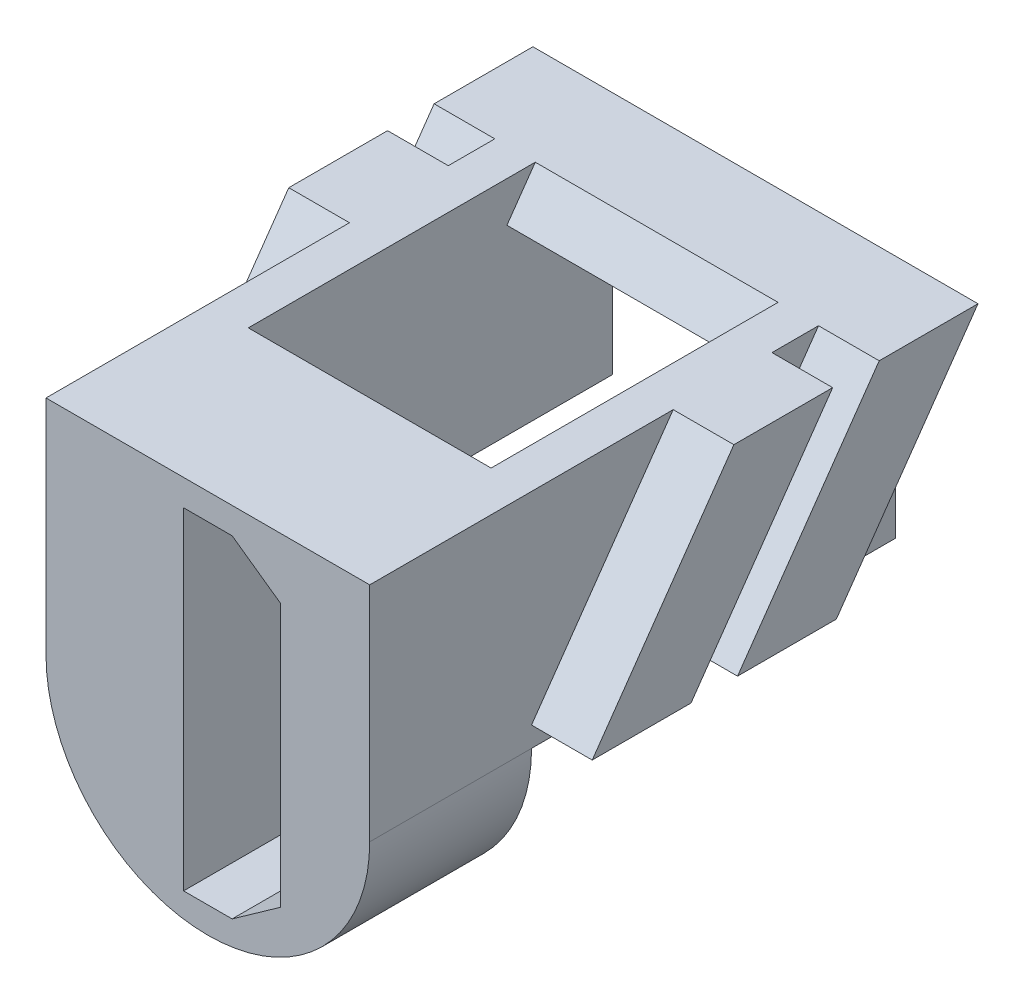
ISO-10303-21;
HEADER;
FILE_DESCRIPTION(('STEP AP214'),'2;1');
FILE_NAME('part.step','',(''),(''),'','','');
FILE_SCHEMA(('AUTOMOTIVE_DESIGN { 1 0 10303 214 1 1 1 1 }'));
ENDSEC;
DATA;
#1=APPLICATION_CONTEXT('core data for automotive mechanical design processes');
#2=APPLICATION_PROTOCOL_DEFINITION('international standard','automotive_design',2000,#1);
#3=PRODUCT_CONTEXT('',#1,'mechanical');
#4=PRODUCT('Part','Part','',(#3));
#5=PRODUCT_RELATED_PRODUCT_CATEGORY('part','',(#4));
#6=PRODUCT_DEFINITION_FORMATION('','',#4);
#7=PRODUCT_DEFINITION_CONTEXT('part definition',#1,'design');
#8=PRODUCT_DEFINITION('design','',#6,#7);
#9=PRODUCT_DEFINITION_SHAPE('','',#8);
#10=(LENGTH_UNIT() NAMED_UNIT(*) SI_UNIT(.MILLI.,.METRE.));
#11=(NAMED_UNIT(*) PLANE_ANGLE_UNIT() SI_UNIT($,.RADIAN.));
#12=(NAMED_UNIT(*) SI_UNIT($,.STERADIAN.) SOLID_ANGLE_UNIT());
#13=UNCERTAINTY_MEASURE_WITH_UNIT(LENGTH_MEASURE(1.E-05),#10,'distance_accuracy_value','');
#14=(GEOMETRIC_REPRESENTATION_CONTEXT(3) GLOBAL_UNCERTAINTY_ASSIGNED_CONTEXT((#13)) GLOBAL_UNIT_ASSIGNED_CONTEXT((#10,
#11,#12)) REPRESENTATION_CONTEXT('',''));
#15=CARTESIAN_POINT('',(0.,0.,0.));
#16=DIRECTION('',(0.,0.,1.));
#17=DIRECTION('',(1.,0.,0.));
#18=AXIS2_PLACEMENT_3D('',#15,#16,#17);
#19=CARTESIAN_POINT('',(-3.,4.75,-22.5));
#20=DIRECTION('',(-1.,0.,0.));
#21=DIRECTION('',(0.,-1.,0.));
#22=AXIS2_PLACEMENT_3D('',#19,#20,#21);
#23=PLANE('',#22);
#24=DIRECTION('',(0.,0.819152044288989,-0.573576436351051));
#25=VECTOR('',#24,1.);
#26=CARTESIAN_POINT('',(-3.,12.0170666710925,-12.1215532188174));
#27=LINE('',#26,#25);
#28=CARTESIAN_POINT('',(-3.,3.75,-6.33289081683612));
#29=VERTEX_POINT('',#28);
#30=CARTESIAN_POINT('',(-3.,3.98865664684379,-6.5));
#31=VERTEX_POINT('',#30);
#32=EDGE_CURVE('E310',#29,#31,#27,.T.);
#33=ORIENTED_EDGE('',*,*,#32,.F.);
#34=DIRECTION('',(0.,0.,-1.));
#35=VECTOR('',#34,1.);
#36=CARTESIAN_POINT('',(-3.,3.75,-22.5));
#37=LINE('',#36,#35);
#38=CARTESIAN_POINT('',(-3.,3.75,-3.89134163931321));
#39=VERTEX_POINT('',#38);
#40=EDGE_CURVE('E302',#39,#29,#37,.T.);
#41=ORIENTED_EDGE('',*,*,#40,.F.);
#42=DIRECTION('',(0.,-0.819152044288989,0.57357643635105));
#43=VECTOR('',#42,1.);
#44=CARTESIAN_POINT('',(-3.,13.1642195437946,-10.4832491302394));
#45=LINE('',#44,#43);
#46=CARTESIAN_POINT('',(-3.,4.75,-4.59154917752293));
#47=VERTEX_POINT('',#46);
#48=EDGE_CURVE('E307',#47,#39,#45,.T.);
#49=ORIENTED_EDGE('',*,*,#48,.F.);
#50=DIRECTION('',(0.,0.,1.));
#51=VECTOR('',#50,1.);
#52=CARTESIAN_POINT('',(-3.,4.75,-22.5));
#53=LINE('',#52,#51);
#54=CARTESIAN_POINT('',(-3.,4.75,2.5));
#55=VERTEX_POINT('',#54);
#56=EDGE_CURVE('E338',#47,#55,#53,.T.);
#57=ORIENTED_EDGE('',*,*,#56,.T.);
#58=DIRECTION('',(0.,-1.,0.));
#59=VECTOR('',#58,1.);
#60=CARTESIAN_POINT('',(-3.,4.75,2.5));
#61=LINE('',#60,#59);
#62=CARTESIAN_POINT('',(-3.,-0.75,2.5));
#63=VERTEX_POINT('',#62);
#64=EDGE_CURVE('E325',#55,#63,#61,.T.);
#65=ORIENTED_EDGE('',*,*,#64,.T.);
#66=DIRECTION('',(0.,0.,1.));
#67=VECTOR('',#66,1.);
#68=CARTESIAN_POINT('',(-3.,-0.75,-22.5));
#69=LINE('',#68,#67);
#70=CARTESIAN_POINT('',(-3.,-0.75,-6.5));
#71=VERTEX_POINT('',#70);
#72=EDGE_CURVE('E336',#71,#63,#69,.T.);
#73=ORIENTED_EDGE('',*,*,#72,.F.);
#74=DIRECTION('',(0.,-1.,0.));
#75=VECTOR('',#74,1.);
#76=CARTESIAN_POINT('',(-3.,-0.75,-6.5));
#77=LINE('',#76,#75);
#78=EDGE_CURVE('E347',#31,#71,#77,.T.);
#79=ORIENTED_EDGE('',*,*,#78,.F.);
#80=EDGE_LOOP('',(#33,#41,#49,#57,#65,#73,#79));
#81=FACE_BOUND('',#80,.T.);
#82=ADVANCED_FACE('F38',(#81),#23,.F.);
#83=CARTESIAN_POINT('',(3.,-0.75,-22.5));
#84=DIRECTION('',(1.,0.,0.));
#85=DIRECTION('',(0.,0.,-1.));
#86=AXIS2_PLACEMENT_3D('',#83,#84,#85);
#87=PLANE('',#86);
#88=DIRECTION('',(0.,-0.819152044288989,0.573576436351051));
#89=VECTOR('',#88,1.);
#90=CARTESIAN_POINT('',(3.,8.3265112769469,-9.53739851165612));
#91=LINE('',#90,#89);
#92=CARTESIAN_POINT('',(3.,3.98865664684379,-6.5));
#93=VERTEX_POINT('',#92);
#94=CARTESIAN_POINT('',(3.,3.75,-6.33289081683612));
#95=VERTEX_POINT('',#94);
#96=EDGE_CURVE('E11',#93,#95,#91,.T.);
#97=ORIENTED_EDGE('',*,*,#96,.F.);
#98=DIRECTION('',(0.,1.,0.));
#99=VECTOR('',#98,1.);
#100=CARTESIAN_POINT('',(3.,-0.75,-6.5));
#101=LINE('',#100,#99);
#102=CARTESIAN_POINT('',(3.,-0.75,-6.5));
#103=VERTEX_POINT('',#102);
#104=EDGE_CURVE('E335',#103,#93,#101,.T.);
#105=ORIENTED_EDGE('',*,*,#104,.F.);
#106=DIRECTION('',(0.,0.,1.));
#107=VECTOR('',#106,1.);
#108=CARTESIAN_POINT('',(3.,-0.75,-22.5));
#109=LINE('',#108,#107);
#110=CARTESIAN_POINT('',(3.,-0.75,2.5));
#111=VERTEX_POINT('',#110);
#112=EDGE_CURVE('E342',#103,#111,#109,.T.);
#113=ORIENTED_EDGE('',*,*,#112,.T.);
#114=DIRECTION('',(0.,1.,0.));
#115=VECTOR('',#114,1.);
#116=CARTESIAN_POINT('',(3.,-0.75,2.5));
#117=LINE('',#116,#115);
#118=CARTESIAN_POINT('',(3.,4.75,2.5));
#119=VERTEX_POINT('',#118);
#120=EDGE_CURVE('E319',#111,#119,#117,.T.);
#121=ORIENTED_EDGE('',*,*,#120,.T.);
#122=DIRECTION('',(0.,0.,1.));
#123=VECTOR('',#122,1.);
#124=CARTESIAN_POINT('',(3.,4.75,-22.5));
#125=LINE('',#124,#123);
#126=CARTESIAN_POINT('',(3.,4.75,-4.59154917752293));
#127=VERTEX_POINT('',#126);
#128=EDGE_CURVE('E340',#127,#119,#125,.T.);
#129=ORIENTED_EDGE('',*,*,#128,.F.);
#130=DIRECTION('',(0.,0.819152044288989,-0.57357643635105));
#131=VECTOR('',#130,1.);
#132=CARTESIAN_POINT('',(3.,9.47366414964899,-7.89909442307814));
#133=LINE('',#132,#131);
#134=CARTESIAN_POINT('',(3.,3.75,-3.8913416393132));
#135=VERTEX_POINT('',#134);
#136=EDGE_CURVE('E46',#135,#127,#133,.T.);
#137=ORIENTED_EDGE('',*,*,#136,.F.);
#138=DIRECTION('',(0.,0.,1.));
#139=VECTOR('',#138,1.);
#140=CARTESIAN_POINT('',(3.,3.75,-22.5));
#141=LINE('',#140,#139);
#142=EDGE_CURVE('E493',#95,#135,#141,.T.);
#143=ORIENTED_EDGE('',*,*,#142,.F.);
#144=EDGE_LOOP('',(#97,#105,#113,#121,#129,#137,#143));
#145=FACE_BOUND('',#144,.T.);
#146=ADVANCED_FACE('F566',(#145),#87,.F.);
#147=CARTESIAN_POINT('',(0.,-0.75,-6.5));
#148=DIRECTION('',(0.,0.,1.));
#149=DIRECTION('',(1.,0.,0.));
#150=AXIS2_PLACEMENT_3D('',#147,#148,#149);
#151=PLANE('',#150);
#152=ORIENTED_EDGE('',*,*,#78,.T.);
#153=DIRECTION('',(-1.,0.,0.));
#154=VECTOR('',#153,1.);
#155=CARTESIAN_POINT('',(0.,-0.75,-6.5));
#156=LINE('',#155,#154);
#157=CARTESIAN_POINT('',(-4.,-0.75,-6.5));
#158=VERTEX_POINT('',#157);
#159=EDGE_CURVE('E490',#71,#158,#156,.T.);
#160=ORIENTED_EDGE('',*,*,#159,.T.);
#161=DIRECTION('',(0.,-1.,0.));
#162=VECTOR('',#161,1.);
#163=CARTESIAN_POINT('',(-4.,-0.75,-6.5));
#164=LINE('',#163,#162);
#165=CARTESIAN_POINT('',(-4.,3.98865664684379,-6.5));
#166=VERTEX_POINT('',#165);
#167=EDGE_CURVE('E445',#166,#158,#164,.T.);
#168=ORIENTED_EDGE('',*,*,#167,.F.);
#169=DIRECTION('',(1.,0.,0.));
#170=VECTOR('',#169,1.);
#171=CARTESIAN_POINT('',(0.,3.98865664684379,-6.5));
#172=LINE('',#171,#170);
#173=EDGE_CURVE('E479',#166,#31,#172,.T.);
#174=ORIENTED_EDGE('',*,*,#173,.T.);
#175=EDGE_LOOP('',(#152,#160,#168,#174));
#176=FACE_BOUND('',#175,.T.);
#177=ADVANCED_FACE('F560',(#176),#151,.F.);
#178=CARTESIAN_POINT('',(0.,-0.75,6.5));
#179=DIRECTION('',(0.,0.,-1.));
#180=DIRECTION('',(-1.,0.,0.));
#181=AXIS2_PLACEMENT_3D('',#178,#179,#180);
#182=CYLINDRICAL_SURFACE('',#181,4.);
#183=DIRECTION('',(0.,0.,-1.));
#184=VECTOR('',#183,1.);
#185=CARTESIAN_POINT('',(-4.,-0.75,6.5));
#186=LINE('',#185,#184);
#187=CARTESIAN_POINT('',(-4.,-0.75,6.5));
#188=VERTEX_POINT('',#187);
#189=CARTESIAN_POINT('',(-4.,-0.75,2.5));
#190=VERTEX_POINT('',#189);
#191=EDGE_CURVE('E451',#188,#190,#186,.T.);
#192=ORIENTED_EDGE('',*,*,#191,.T.);
#193=CARTESIAN_POINT('',(0.,-0.75,2.5));
#194=DIRECTION('',(0.,0.,1.));
#195=DIRECTION('',(1.,0.,0.));
#196=AXIS2_PLACEMENT_3D('',#193,#194,#195);
#197=CIRCLE('',#196,4.);
#198=CARTESIAN_POINT('',(4.,-0.749999999999999,2.5));
#199=VERTEX_POINT('',#198);
#200=EDGE_CURVE('E313',#190,#199,#197,.T.);
#201=ORIENTED_EDGE('',*,*,#200,.T.);
#202=DIRECTION('',(0.,0.,-1.));
#203=VECTOR('',#202,1.);
#204=CARTESIAN_POINT('',(4.,-0.749999999999999,6.5));
#205=LINE('',#204,#203);
#206=CARTESIAN_POINT('',(4.,-0.749999999999999,6.5));
#207=VERTEX_POINT('',#206);
#208=EDGE_CURVE('E466',#207,#199,#205,.T.);
#209=ORIENTED_EDGE('',*,*,#208,.F.);
#210=CARTESIAN_POINT('',(0.,-0.75,6.5));
#211=DIRECTION('',(0.,0.,1.));
#212=DIRECTION('',(1.,0.,0.));
#213=AXIS2_PLACEMENT_3D('',#210,#211,#212);
#214=CIRCLE('',#213,4.);
#215=EDGE_CURVE('E441',#188,#207,#214,.T.);
#216=ORIENTED_EDGE('',*,*,#215,.F.);
#217=EDGE_LOOP('',(#192,#201,#209,#216));
#218=FACE_BOUND('',#217,.T.);
#219=ADVANCED_FACE('F40',(#218),#182,.T.);
#220=CARTESIAN_POINT('',(4.,4.75,6.5));
#221=DIRECTION('',(-1.,0.,0.));
#222=DIRECTION('',(0.,0.,1.));
#223=AXIS2_PLACEMENT_3D('',#220,#221,#222);
#224=PLANE('',#223);
#225=DIRECTION('',(0.,1.,0.));
#226=VECTOR('',#225,1.);
#227=CARTESIAN_POINT('',(4.,4.75,-6.5));
#228=LINE('',#227,#226);
#229=CARTESIAN_POINT('',(4.,-0.749999999999999,-6.5));
#230=VERTEX_POINT('',#229);
#231=CARTESIAN_POINT('',(4.,3.98865664684379,-6.5));
#232=VERTEX_POINT('',#231);
#233=EDGE_CURVE('E440',#230,#232,#228,.T.);
#234=ORIENTED_EDGE('',*,*,#233,.T.);
#235=DIRECTION('',(0.,-0.819152044288989,0.57357643635105));
#236=VECTOR('',#235,1.);
#237=CARTESIAN_POINT('',(4.,-1.60847633030327,-2.58084529703943));
#238=LINE('',#237,#236);
#239=CARTESIAN_POINT('',(4.,-0.249999999999999,-3.53206066399726));
#240=VERTEX_POINT('',#239);
#241=EDGE_CURVE('E387',#232,#240,#238,.T.);
#242=ORIENTED_EDGE('',*,*,#241,.T.);
#243=DIRECTION('',(0.,0.,1.));
#244=VECTOR('',#243,1.);
#245=CARTESIAN_POINT('',(4.,-0.250000000000001,6.5));
#246=LINE('',#245,#244);
#247=CARTESIAN_POINT('',(4.,-0.25,-1.09051148647434));
#248=VERTEX_POINT('',#247);
#249=EDGE_CURVE('E391',#240,#248,#246,.T.);
#250=ORIENTED_EDGE('',*,*,#249,.T.);
#251=DIRECTION('',(0.,0.819152044288989,-0.57357643635105));
#252=VECTOR('',#251,1.);
#253=CARTESIAN_POINT('',(4.,-0.461323457601167,-0.942541208461455));
#254=LINE('',#253,#252);
#255=CARTESIAN_POINT('',(4.,4.75,-4.59154917752292));
#256=VERTEX_POINT('',#255);
#257=EDGE_CURVE('E389',#248,#256,#254,.T.);
#258=ORIENTED_EDGE('',*,*,#257,.T.);
#259=DIRECTION('',(0.,0.,-1.));
#260=VECTOR('',#259,1.);
#261=CARTESIAN_POINT('',(4.,4.75,6.5));
#262=LINE('',#261,#260);
#263=CARTESIAN_POINT('',(4.,4.75,-3.44154917752292));
#264=VERTEX_POINT('',#263);
#265=EDGE_CURVE('E462',#264,#256,#262,.T.);
#266=ORIENTED_EDGE('',*,*,#265,.F.);
#267=DIRECTION('',(0.,-0.819152044288989,0.57357643635105));
#268=VECTOR('',#267,1.);
#269=CARTESIAN_POINT('',(4.,0.0789997993507312,-0.170879626049198));
#270=LINE('',#269,#268);
#271=CARTESIAN_POINT('',(4.,-0.249999999999999,0.0594885135256655));
#272=VERTEX_POINT('',#271);
#273=EDGE_CURVE('E437',#264,#272,#270,.T.);
#274=ORIENTED_EDGE('',*,*,#273,.T.);
#275=DIRECTION('',(0.,0.,1.));
#276=VECTOR('',#275,1.);
#277=CARTESIAN_POINT('',(4.,-0.249999999999999,6.5));
#278=LINE('',#277,#276);
#279=CARTESIAN_POINT('',(4.,-0.249999999999999,2.50103769104859));
#280=VERTEX_POINT('',#279);
#281=EDGE_CURVE('E434',#272,#280,#278,.T.);
#282=ORIENTED_EDGE('',*,*,#281,.T.);
#283=DIRECTION('',(0.,0.819152044288989,-0.57357643635105));
#284=VECTOR('',#283,1.);
#285=CARTESIAN_POINT('',(4.,1.22615267205283,1.46742446252878));
#286=LINE('',#285,#284);
#287=CARTESIAN_POINT('',(4.,4.75,-0.999999999999998));
#288=VERTEX_POINT('',#287);
#289=EDGE_CURVE('E420',#280,#288,#286,.T.);
#290=ORIENTED_EDGE('',*,*,#289,.T.);
#291=CARTESIAN_POINT('',(4.,4.75,6.5));
#292=VERTEX_POINT('',#291);
#293=EDGE_CURVE('E463',#292,#288,#262,.T.);
#294=ORIENTED_EDGE('',*,*,#293,.F.);
#295=DIRECTION('',(0.,1.,0.));
#296=VECTOR('',#295,1.);
#297=CARTESIAN_POINT('',(4.,4.75,6.5));
#298=LINE('',#297,#296);
#299=EDGE_CURVE('E444',#207,#292,#298,.T.);
#300=ORIENTED_EDGE('',*,*,#299,.F.);
#301=ORIENTED_EDGE('',*,*,#208,.T.);
#302=DIRECTION('',(0.,0.,1.));
#303=VECTOR('',#302,1.);
#304=CARTESIAN_POINT('',(4.,-0.749999999999999,-22.5));
#305=LINE('',#304,#303);
#306=EDGE_CURVE('E331',#230,#199,#305,.T.);
#307=ORIENTED_EDGE('',*,*,#306,.F.);
#308=EDGE_LOOP('',(#234,#242,#250,#258,#266,#274,#282,#290,#294,#300,#301,#307));
#309=FACE_BOUND('',#308,.T.);
#310=ADVANCED_FACE('F575',(#309),#224,.F.);
#311=CARTESIAN_POINT('',(-4.,4.75,6.5));
#312=DIRECTION('',(0.,-1.,0.));
#313=DIRECTION('',(1.,0.,0.));
#314=AXIS2_PLACEMENT_3D('',#311,#312,#313);
#315=PLANE('',#314);
#316=ORIENTED_EDGE('',*,*,#56,.F.);
#317=DIRECTION('',(-1.,0.,0.));
#318=VECTOR('',#317,1.);
#319=CARTESIAN_POINT('',(8.79706464311077,4.75,-4.59154917752292));
#320=LINE('',#319,#318);
#321=EDGE_CURVE('E296',#127,#47,#320,.T.);
#322=ORIENTED_EDGE('',*,*,#321,.F.);
#323=ORIENTED_EDGE('',*,*,#128,.T.);
#324=DIRECTION('',(-1.,0.,0.));
#325=VECTOR('',#324,1.);
#326=CARTESIAN_POINT('',(3.,4.75,2.5));
#327=LINE('',#326,#325);
#328=EDGE_CURVE('E322',#119,#55,#327,.T.);
#329=ORIENTED_EDGE('',*,*,#328,.T.);
#330=EDGE_LOOP('',(#316,#322,#323,#329));
#331=FACE_BOUND('',#330,.T.);
#332=DIRECTION('',(0.,0.,1.));
#333=VECTOR('',#332,1.);
#334=CARTESIAN_POINT('',(5.5,4.75,-4.59154917752292));
#335=LINE('',#334,#333);
#336=CARTESIAN_POINT('',(5.5,4.75,-7.03309835504584));
#337=VERTEX_POINT('',#336);
#338=CARTESIAN_POINT('',(5.5,4.75,-4.59154917752292));
#339=VERTEX_POINT('',#338);
#340=EDGE_CURVE('E350',#337,#339,#335,.T.);
#341=ORIENTED_EDGE('',*,*,#340,.F.);
#342=DIRECTION('',(1.,0.,0.));
#343=VECTOR('',#342,1.);
#344=CARTESIAN_POINT('',(-5.5,4.75,-7.03309835504584));
#345=LINE('',#344,#343);
#346=CARTESIAN_POINT('',(-5.5,4.75,-7.03309835504584));
#347=VERTEX_POINT('',#346);
#348=EDGE_CURVE('E371',#347,#337,#345,.T.);
#349=ORIENTED_EDGE('',*,*,#348,.F.);
#350=DIRECTION('',(0.,0.,1.));
#351=VECTOR('',#350,1.);
#352=CARTESIAN_POINT('',(-5.5,4.75,-4.59154917752292));
#353=LINE('',#352,#351);
#354=CARTESIAN_POINT('',(-5.5,4.75,-4.59154917752292));
#355=VERTEX_POINT('',#354);
#356=EDGE_CURVE('E360',#347,#355,#353,.T.);
#357=ORIENTED_EDGE('',*,*,#356,.T.);
#358=DIRECTION('',(1.,0.,0.));
#359=VECTOR('',#358,1.);
#360=CARTESIAN_POINT('',(-5.5,4.75,-4.59154917752292));
#361=LINE('',#360,#359);
#362=CARTESIAN_POINT('',(-4.,4.75,-4.59154917752292));
#363=VERTEX_POINT('',#362);
#364=EDGE_CURVE('E383',#355,#363,#361,.T.);
#365=ORIENTED_EDGE('',*,*,#364,.T.);
#366=DIRECTION('',(0.,0.,-1.));
#367=VECTOR('',#366,1.);
#368=CARTESIAN_POINT('',(-4.,4.75,6.5));
#369=LINE('',#368,#367);
#370=CARTESIAN_POINT('',(-4.,4.75,-3.44154917752292));
#371=VERTEX_POINT('',#370);
#372=EDGE_CURVE('E458',#371,#363,#369,.T.);
#373=ORIENTED_EDGE('',*,*,#372,.F.);
#374=DIRECTION('',(1.,0.,0.));
#375=VECTOR('',#374,1.);
#376=CARTESIAN_POINT('',(-5.5,4.75,-3.44154917752292));
#377=LINE('',#376,#375);
#378=CARTESIAN_POINT('',(-5.5,4.75,-3.44154917752292));
#379=VERTEX_POINT('',#378);
#380=EDGE_CURVE('E418',#379,#371,#377,.T.);
#381=ORIENTED_EDGE('',*,*,#380,.F.);
#382=DIRECTION('',(0.,0.,1.));
#383=VECTOR('',#382,1.);
#384=CARTESIAN_POINT('',(-5.5,4.75,-3.44154917752292));
#385=LINE('',#384,#383);
#386=CARTESIAN_POINT('',(-5.5,4.75,-1.));
#387=VERTEX_POINT('',#386);
#388=EDGE_CURVE('E406',#379,#387,#385,.T.);
#389=ORIENTED_EDGE('',*,*,#388,.T.);
#390=DIRECTION('',(1.,0.,0.));
#391=VECTOR('',#390,1.);
#392=CARTESIAN_POINT('',(-5.5,4.75,-1.));
#393=LINE('',#392,#391);
#394=CARTESIAN_POINT('',(-4.,4.75,-1.));
#395=VERTEX_POINT('',#394);
#396=EDGE_CURVE('E429',#387,#395,#393,.T.);
#397=ORIENTED_EDGE('',*,*,#396,.T.);
#398=CARTESIAN_POINT('',(-4.,4.75,6.5));
#399=VERTEX_POINT('',#398);
#400=EDGE_CURVE('E459',#399,#395,#369,.T.);
#401=ORIENTED_EDGE('',*,*,#400,.F.);
#402=DIRECTION('',(-1.,0.,0.));
#403=VECTOR('',#402,1.);
#404=CARTESIAN_POINT('',(-4.,4.75,6.5));
#405=LINE('',#404,#403);
#406=EDGE_CURVE('E447',#292,#399,#405,.T.);
#407=ORIENTED_EDGE('',*,*,#406,.F.);
#408=ORIENTED_EDGE('',*,*,#293,.T.);
#409=CARTESIAN_POINT('',(5.5,4.75,-1.));
#410=VERTEX_POINT('',#409);
#411=EDGE_CURVE('E417',#288,#410,#393,.T.);
#412=ORIENTED_EDGE('',*,*,#411,.T.);
#413=DIRECTION('',(0.,0.,1.));
#414=VECTOR('',#413,1.);
#415=CARTESIAN_POINT('',(5.5,4.75,-3.44154917752292));
#416=LINE('',#415,#414);
#417=CARTESIAN_POINT('',(5.5,4.75,-3.44154917752292));
#418=VERTEX_POINT('',#417);
#419=EDGE_CURVE('E394',#418,#410,#416,.T.);
#420=ORIENTED_EDGE('',*,*,#419,.F.);
#421=EDGE_CURVE('E421',#264,#418,#377,.T.);
#422=ORIENTED_EDGE('',*,*,#421,.F.);
#423=ORIENTED_EDGE('',*,*,#265,.T.);
#424=EDGE_CURVE('E370',#256,#339,#361,.T.);
#425=ORIENTED_EDGE('',*,*,#424,.T.);
#426=EDGE_LOOP('',(#341,#349,#357,#365,#373,#381,#389,#397,#401,#407,#408,#412,#420,#422,#423,#425));
#427=FACE_BOUND('',#426,.T.);
#428=ADVANCED_FACE('F503',(#331,#427),#315,.F.);
#429=CARTESIAN_POINT('',(-4.,-0.75,6.5));
#430=DIRECTION('',(1.,0.,0.));
#431=DIRECTION('',(0.,0.,-1.));
#432=AXIS2_PLACEMENT_3D('',#429,#430,#431);
#433=PLANE('',#432);
#434=DIRECTION('',(0.,0.,-1.));
#435=VECTOR('',#434,1.);
#436=CARTESIAN_POINT('',(-4.,-0.250000000000001,6.5));
#437=LINE('',#436,#435);
#438=CARTESIAN_POINT('',(-4.,-0.25,-1.09051148647434));
#439=VERTEX_POINT('',#438);
#440=CARTESIAN_POINT('',(-4.,-0.249999999999999,-3.53206066399726));
#441=VERTEX_POINT('',#440);
#442=EDGE_CURVE('E484',#439,#441,#437,.T.);
#443=ORIENTED_EDGE('',*,*,#442,.T.);
#444=DIRECTION('',(0.,0.819152044288989,-0.57357643635105));
#445=VECTOR('',#444,1.);
#446=CARTESIAN_POINT('',(-4.,-5.29903172444883,0.00330941012182707));
#447=LINE('',#446,#445);
#448=EDGE_CURVE('E374',#441,#166,#447,.T.);
#449=ORIENTED_EDGE('',*,*,#448,.T.);
#450=ORIENTED_EDGE('',*,*,#167,.T.);
#451=DIRECTION('',(0.,0.,1.));
#452=VECTOR('',#451,1.);
#453=CARTESIAN_POINT('',(-4.,-0.75,-22.5));
#454=LINE('',#453,#452);
#455=EDGE_CURVE('E332',#158,#190,#454,.T.);
#456=ORIENTED_EDGE('',*,*,#455,.T.);
#457=ORIENTED_EDGE('',*,*,#191,.F.);
#458=DIRECTION('',(0.,-1.,0.));
#459=VECTOR('',#458,1.);
#460=CARTESIAN_POINT('',(-4.,-0.75,6.5));
#461=LINE('',#460,#459);
#462=EDGE_CURVE('E449',#399,#188,#461,.T.);
#463=ORIENTED_EDGE('',*,*,#462,.F.);
#464=ORIENTED_EDGE('',*,*,#400,.T.);
#465=DIRECTION('',(0.,-0.819152044288989,0.57357643635105));
#466=VECTOR('',#465,1.);
#467=CARTESIAN_POINT('',(-4.,-2.46440272209273,4.05157916969003));
#468=LINE('',#467,#466);
#469=CARTESIAN_POINT('',(-4.,-0.25,2.50103769104859));
#470=VERTEX_POINT('',#469);
#471=EDGE_CURVE('E469',#395,#470,#468,.T.);
#472=ORIENTED_EDGE('',*,*,#471,.T.);
#473=DIRECTION('',(0.,0.,-1.));
#474=VECTOR('',#473,1.);
#475=CARTESIAN_POINT('',(-4.,-0.249999999999999,6.5));
#476=LINE('',#475,#474);
#477=CARTESIAN_POINT('',(-4.,-0.249999999999999,0.0594885135256655));
#478=VERTEX_POINT('',#477);
#479=EDGE_CURVE('E472',#470,#478,#476,.T.);
#480=ORIENTED_EDGE('',*,*,#479,.T.);
#481=DIRECTION('',(0.,0.819152044288989,-0.57357643635105));
#482=VECTOR('',#481,1.);
#483=CARTESIAN_POINT('',(-4.,-3.61155559479483,2.41327508111206));
#484=LINE('',#483,#482);
#485=EDGE_CURVE('E475',#478,#371,#484,.T.);
#486=ORIENTED_EDGE('',*,*,#485,.T.);
#487=ORIENTED_EDGE('',*,*,#372,.T.);
#488=DIRECTION('',(0.,-0.819152044288989,0.57357643635105));
#489=VECTOR('',#488,1.);
#490=CARTESIAN_POINT('',(-4.,-4.15187885174673,1.6416134986998));
#491=LINE('',#490,#489);
#492=EDGE_CURVE('E482',#363,#439,#491,.T.);
#493=ORIENTED_EDGE('',*,*,#492,.T.);
#494=EDGE_LOOP('',(#443,#449,#450,#456,#457,#463,#464,#472,#480,#486,#487,#493));
#495=FACE_BOUND('',#494,.T.);
#496=ADVANCED_FACE('F518',(#495),#433,.F.);
#497=CARTESIAN_POINT('',(0.,-0.75,6.5));
#498=DIRECTION('',(0.,0.,1.));
#499=DIRECTION('',(1.,0.,0.));
#500=AXIS2_PLACEMENT_3D('',#497,#498,#499);
#501=PLANE('',#500);
#502=DIRECTION('',(-1.,0.,0.));
#503=VECTOR('',#502,1.);
#504=CARTESIAN_POINT('',(0.6,4.1,6.5));
#505=LINE('',#504,#503);
#506=CARTESIAN_POINT('',(0.6,4.1,6.5));
#507=VERTEX_POINT('',#506);
#508=CARTESIAN_POINT('',(-0.6,4.1,6.5));
#509=VERTEX_POINT('',#508);
#510=EDGE_CURVE('E53',#507,#509,#505,.T.);
#511=ORIENTED_EDGE('',*,*,#510,.F.);
#512=DIRECTION('',(-0.816024481101655,0.578017340780339,0.));
#513=VECTOR('',#512,1.);
#514=CARTESIAN_POINT('',(1.8,3.25,6.5));
#515=LINE('',#514,#513);
#516=CARTESIAN_POINT('',(1.8,3.25,6.5));
#517=VERTEX_POINT('',#516);
#518=EDGE_CURVE('E281',#517,#507,#515,.T.);
#519=ORIENTED_EDGE('',*,*,#518,.F.);
#520=DIRECTION('',(0.,1.,0.));
#521=VECTOR('',#520,1.);
#522=CARTESIAN_POINT('',(1.8,-3.25,6.5));
#523=LINE('',#522,#521);
#524=CARTESIAN_POINT('',(1.8,-3.25,6.5));
#525=VERTEX_POINT('',#524);
#526=EDGE_CURVE('E275',#525,#517,#523,.T.);
#527=ORIENTED_EDGE('',*,*,#526,.F.);
#528=DIRECTION('',(0.816024481101655,0.578017340780339,0.));
#529=VECTOR('',#528,1.);
#530=CARTESIAN_POINT('',(0.6,-4.1,6.5));
#531=LINE('',#530,#529);
#532=CARTESIAN_POINT('',(0.6,-4.1,6.5));
#533=VERTEX_POINT('',#532);
#534=EDGE_CURVE('E273',#533,#525,#531,.T.);
#535=ORIENTED_EDGE('',*,*,#534,.F.);
#536=DIRECTION('',(1.,0.,0.));
#537=VECTOR('',#536,1.);
#538=CARTESIAN_POINT('',(-0.6,-4.1,6.5));
#539=LINE('',#538,#537);
#540=CARTESIAN_POINT('',(-0.6,-4.1,6.5));
#541=VERTEX_POINT('',#540);
#542=EDGE_CURVE('E256',#541,#533,#539,.T.);
#543=ORIENTED_EDGE('',*,*,#542,.F.);
#544=DIRECTION('',(0.,-1.,0.));
#545=VECTOR('',#544,1.);
#546=CARTESIAN_POINT('',(-0.6,4.1,6.5));
#547=LINE('',#546,#545);
#548=EDGE_CURVE('E265',#509,#541,#547,.T.);
#549=ORIENTED_EDGE('',*,*,#548,.F.);
#550=EDGE_LOOP('',(#511,#519,#527,#535,#543,#549));
#551=FACE_BOUND('',#550,.T.);
#552=ORIENTED_EDGE('',*,*,#215,.T.);
#553=ORIENTED_EDGE('',*,*,#299,.T.);
#554=ORIENTED_EDGE('',*,*,#406,.T.);
#555=ORIENTED_EDGE('',*,*,#462,.T.);
#556=EDGE_LOOP('',(#552,#553,#554,#555));
#557=FACE_BOUND('',#556,.T.);
#558=ADVANCED_FACE('F269',(#551,#557),#501,.T.);
#559=DIRECTION('',(-1.,0.,0.));
#560=VECTOR('',#559,1.);
#561=CARTESIAN_POINT('',(0.,-0.75,-6.5));
#562=LINE('',#561,#560);
#563=EDGE_CURVE('E487',#230,#103,#562,.T.);
#564=ORIENTED_EDGE('',*,*,#563,.T.);
#565=ORIENTED_EDGE('',*,*,#104,.T.);
#566=EDGE_CURVE('E478',#93,#232,#172,.T.);
#567=ORIENTED_EDGE('',*,*,#566,.T.);
#568=ORIENTED_EDGE('',*,*,#233,.F.);
#569=EDGE_LOOP('',(#564,#565,#567,#568));
#570=FACE_BOUND('',#569,.T.);
#571=ADVANCED_FACE('F569',(#570),#151,.F.);
#572=CARTESIAN_POINT('',(-5.5,0.,0.));
#573=DIRECTION('',(1.,0.,0.));
#574=DIRECTION('',(0.,0.,-1.));
#575=AXIS2_PLACEMENT_3D('',#572,#573,#574);
#576=PLANE('',#575);
#577=ORIENTED_EDGE('',*,*,#388,.F.);
#578=DIRECTION('',(0.,0.819152044288989,-0.57357643635105));
#579=VECTOR('',#578,1.);
#580=CARTESIAN_POINT('',(-5.5,-0.249999999999999,0.0594885135256655));
#581=LINE('',#580,#579);
#582=CARTESIAN_POINT('',(-5.5,-0.249999999999999,0.0594885135256655));
#583=VERTEX_POINT('',#582);
#584=EDGE_CURVE('E415',#583,#379,#581,.T.);
#585=ORIENTED_EDGE('',*,*,#584,.F.);
#586=DIRECTION('',(0.,0.,-1.));
#587=VECTOR('',#586,1.);
#588=CARTESIAN_POINT('',(-5.5,-0.249999999999999,2.50103769104859));
#589=LINE('',#588,#587);
#590=CARTESIAN_POINT('',(-5.5,-0.249999999999999,2.50103769104859));
#591=VERTEX_POINT('',#590);
#592=EDGE_CURVE('E412',#591,#583,#589,.T.);
#593=ORIENTED_EDGE('',*,*,#592,.F.);
#594=DIRECTION('',(0.,-0.819152044288989,0.57357643635105));
#595=VECTOR('',#594,1.);
#596=CARTESIAN_POINT('',(-5.5,4.75,-1.));
#597=LINE('',#596,#595);
#598=EDGE_CURVE('E409',#387,#591,#597,.T.);
#599=ORIENTED_EDGE('',*,*,#598,.F.);
#600=EDGE_LOOP('',(#577,#585,#593,#599));
#601=FACE_BOUND('',#600,.T.);
#602=ADVANCED_FACE('F535',(#601),#576,.F.);
#603=CARTESIAN_POINT('',(-5.5,4.75,-1.));
#604=DIRECTION('',(0.,0.57357643635105,0.819152044288989));
#605=DIRECTION('',(0.,-0.819152044288989,0.57357643635105));
#606=AXIS2_PLACEMENT_3D('',#603,#604,#605);
#607=PLANE('',#606);
#608=ORIENTED_EDGE('',*,*,#471,.F.);
#609=ORIENTED_EDGE('',*,*,#396,.F.);
#610=ORIENTED_EDGE('',*,*,#598,.T.);
#611=DIRECTION('',(1.,0.,0.));
#612=VECTOR('',#611,1.);
#613=CARTESIAN_POINT('',(-5.5,-0.249999999999999,2.50103769104859));
#614=LINE('',#613,#612);
#615=EDGE_CURVE('E426',#591,#470,#614,.T.);
#616=ORIENTED_EDGE('',*,*,#615,.T.);
#617=EDGE_LOOP('',(#608,#609,#610,#616));
#618=FACE_BOUND('',#617,.T.);
#619=ADVANCED_FACE('F532',(#618),#607,.T.);
#620=CARTESIAN_POINT('',(-5.5,-0.249999999999999,2.50103769104859));
#621=DIRECTION('',(0.,-1.,0.));
#622=DIRECTION('',(0.,0.,-1.));
#623=AXIS2_PLACEMENT_3D('',#620,#621,#622);
#624=PLANE('',#623);
#625=ORIENTED_EDGE('',*,*,#479,.F.);
#626=ORIENTED_EDGE('',*,*,#615,.F.);
#627=ORIENTED_EDGE('',*,*,#592,.T.);
#628=DIRECTION('',(1.,0.,0.));
#629=VECTOR('',#628,1.);
#630=CARTESIAN_POINT('',(-5.5,-0.249999999999999,0.0594885135256655));
#631=LINE('',#630,#629);
#632=EDGE_CURVE('E422',#583,#478,#631,.T.);
#633=ORIENTED_EDGE('',*,*,#632,.T.);
#634=EDGE_LOOP('',(#625,#626,#627,#633));
#635=FACE_BOUND('',#634,.T.);
#636=ADVANCED_FACE('F539',(#635),#624,.T.);
#637=CARTESIAN_POINT('',(-5.5,3.26166509846084,-2.39940586008458));
#638=DIRECTION('',(0.,-0.57357643635105,-0.819152044288989));
#639=DIRECTION('',(0.,0.819152044288989,-0.57357643635105));
#640=AXIS2_PLACEMENT_3D('',#637,#638,#639);
#641=PLANE('',#640);
#642=ORIENTED_EDGE('',*,*,#485,.F.);
#643=ORIENTED_EDGE('',*,*,#632,.F.);
#644=ORIENTED_EDGE('',*,*,#584,.T.);
#645=ORIENTED_EDGE('',*,*,#380,.T.);
#646=EDGE_LOOP('',(#642,#643,#644,#645));
#647=FACE_BOUND('',#646,.T.);
#648=ADVANCED_FACE('F641',(#647),#641,.T.);
#649=ORIENTED_EDGE('',*,*,#273,.F.);
#650=ORIENTED_EDGE('',*,*,#421,.T.);
#651=DIRECTION('',(0.,0.819152044288989,-0.57357643635105));
#652=VECTOR('',#651,1.);
#653=CARTESIAN_POINT('',(5.5,-0.249999999999999,0.0594885135256655));
#654=LINE('',#653,#652);
#655=CARTESIAN_POINT('',(5.5,-0.249999999999999,0.0594885135256655));
#656=VERTEX_POINT('',#655);
#657=EDGE_CURVE('E403',#656,#418,#654,.T.);
#658=ORIENTED_EDGE('',*,*,#657,.F.);
#659=EDGE_CURVE('E425',#272,#656,#631,.T.);
#660=ORIENTED_EDGE('',*,*,#659,.F.);
#661=EDGE_LOOP('',(#649,#650,#658,#660));
#662=FACE_BOUND('',#661,.T.);
#663=ADVANCED_FACE('F588',(#662),#641,.T.);
#664=ORIENTED_EDGE('',*,*,#281,.F.);
#665=ORIENTED_EDGE('',*,*,#659,.T.);
#666=DIRECTION('',(0.,0.,-1.));
#667=VECTOR('',#666,1.);
#668=CARTESIAN_POINT('',(5.5,-0.249999999999999,2.50103769104859));
#669=LINE('',#668,#667);
#670=CARTESIAN_POINT('',(5.5,-0.249999999999999,2.50103769104859));
#671=VERTEX_POINT('',#670);
#672=EDGE_CURVE('E400',#671,#656,#669,.T.);
#673=ORIENTED_EDGE('',*,*,#672,.F.);
#674=EDGE_CURVE('E428',#280,#671,#614,.T.);
#675=ORIENTED_EDGE('',*,*,#674,.F.);
#676=EDGE_LOOP('',(#664,#665,#673,#675));
#677=FACE_BOUND('',#676,.T.);
#678=ADVANCED_FACE('F640',(#677),#624,.T.);
#679=ORIENTED_EDGE('',*,*,#289,.F.);
#680=ORIENTED_EDGE('',*,*,#674,.T.);
#681=DIRECTION('',(0.,-0.819152044288989,0.57357643635105));
#682=VECTOR('',#681,1.);
#683=CARTESIAN_POINT('',(5.5,4.75,-1.));
#684=LINE('',#683,#682);
#685=EDGE_CURVE('E397',#410,#671,#684,.T.);
#686=ORIENTED_EDGE('',*,*,#685,.F.);
#687=ORIENTED_EDGE('',*,*,#411,.F.);
#688=EDGE_LOOP('',(#679,#680,#686,#687));
#689=FACE_BOUND('',#688,.T.);
#690=ADVANCED_FACE('F580',(#689),#607,.T.);
#691=CARTESIAN_POINT('',(5.5,0.,0.));
#692=DIRECTION('',(1.,0.,0.));
#693=DIRECTION('',(0.,0.,-1.));
#694=AXIS2_PLACEMENT_3D('',#691,#692,#693);
#695=PLANE('',#694);
#696=ORIENTED_EDGE('',*,*,#419,.T.);
#697=ORIENTED_EDGE('',*,*,#685,.T.);
#698=ORIENTED_EDGE('',*,*,#672,.T.);
#699=ORIENTED_EDGE('',*,*,#657,.T.);
#700=EDGE_LOOP('',(#696,#697,#698,#699));
#701=FACE_BOUND('',#700,.T.);
#702=ADVANCED_FACE('F584',(#701),#695,.T.);
#703=CARTESIAN_POINT('',(-5.5,-0.25,-1.09051148647434));
#704=DIRECTION('',(0.,-1.,0.));
#705=DIRECTION('',(0.,0.,-1.));
#706=AXIS2_PLACEMENT_3D('',#703,#704,#705);
#707=PLANE('',#706);
#708=ORIENTED_EDGE('',*,*,#249,.F.);
#709=DIRECTION('',(1.,0.,0.));
#710=VECTOR('',#709,1.);
#711=CARTESIAN_POINT('',(-5.5,-0.249999999999999,-3.53206066399726));
#712=LINE('',#711,#710);
#713=CARTESIAN_POINT('',(5.5,-0.249999999999999,-3.53206066399726));
#714=VERTEX_POINT('',#713);
#715=EDGE_CURVE('E378',#240,#714,#712,.T.);
#716=ORIENTED_EDGE('',*,*,#715,.T.);
#717=DIRECTION('',(0.,0.,-1.));
#718=VECTOR('',#717,1.);
#719=CARTESIAN_POINT('',(5.5,-0.25,-1.09051148647434));
#720=LINE('',#719,#718);
#721=CARTESIAN_POINT('',(5.5,-0.25,-1.09051148647434));
#722=VERTEX_POINT('',#721);
#723=EDGE_CURVE('E355',#722,#714,#720,.T.);
#724=ORIENTED_EDGE('',*,*,#723,.F.);
#725=DIRECTION('',(1.,0.,0.));
#726=VECTOR('',#725,1.);
#727=CARTESIAN_POINT('',(-5.5,-0.25,-1.09051148647434));
#728=LINE('',#727,#726);
#729=EDGE_CURVE('E382',#248,#722,#728,.T.);
#730=ORIENTED_EDGE('',*,*,#729,.F.);
#731=EDGE_LOOP('',(#708,#716,#724,#730));
#732=FACE_BOUND('',#731,.T.);
#733=ADVANCED_FACE('F604',(#732),#707,.T.);
#734=ORIENTED_EDGE('',*,*,#442,.F.);
#735=CARTESIAN_POINT('',(-5.5,-0.25,-1.09051148647434));
#736=VERTEX_POINT('',#735);
#737=EDGE_CURVE('E379',#736,#439,#728,.T.);
#738=ORIENTED_EDGE('',*,*,#737,.F.);
#739=DIRECTION('',(0.,0.,-1.));
#740=VECTOR('',#739,1.);
#741=CARTESIAN_POINT('',(-5.5,-0.25,-1.09051148647434));
#742=LINE('',#741,#740);
#743=CARTESIAN_POINT('',(-5.5,-0.249999999999999,-3.53206066399726));
#744=VERTEX_POINT('',#743);
#745=EDGE_CURVE('E365',#736,#744,#742,.T.);
#746=ORIENTED_EDGE('',*,*,#745,.T.);
#747=EDGE_CURVE('E375',#744,#441,#712,.T.);
#748=ORIENTED_EDGE('',*,*,#747,.T.);
#749=EDGE_LOOP('',(#734,#738,#746,#748));
#750=FACE_BOUND('',#749,.T.);
#751=ADVANCED_FACE('F555',(#750),#707,.T.);
#752=CARTESIAN_POINT('',(-5.5,3.46294266460817,-3.69034192917345));
#753=DIRECTION('',(0.,0.57357643635105,0.819152044288989));
#754=DIRECTION('',(0.,-0.819152044288989,0.57357643635105));
#755=AXIS2_PLACEMENT_3D('',#752,#753,#754);
#756=PLANE('',#755);
#757=ORIENTED_EDGE('',*,*,#424,.F.);
#758=ORIENTED_EDGE('',*,*,#257,.F.);
#759=ORIENTED_EDGE('',*,*,#729,.T.);
#760=DIRECTION('',(0.,-0.819152044288989,0.573576436351051));
#761=VECTOR('',#760,1.);
#762=CARTESIAN_POINT('',(5.5,4.75,-4.59154917752292));
#763=LINE('',#762,#761);
#764=EDGE_CURVE('E353',#339,#722,#763,.T.);
#765=ORIENTED_EDGE('',*,*,#764,.F.);
#766=EDGE_LOOP('',(#757,#758,#759,#765));
#767=FACE_BOUND('',#766,.T.);
#768=ADVANCED_FACE('F597',(#767),#756,.T.);
#769=DIRECTION('',(0.,-0.819152044288989,0.573576436351051));
#770=VECTOR('',#769,1.);
#771=CARTESIAN_POINT('',(-5.5,4.75,-4.59154917752292));
#772=LINE('',#771,#770);
#773=EDGE_CURVE('E363',#355,#736,#772,.T.);
#774=ORIENTED_EDGE('',*,*,#773,.T.);
#775=ORIENTED_EDGE('',*,*,#737,.T.);
#776=ORIENTED_EDGE('',*,*,#492,.F.);
#777=ORIENTED_EDGE('',*,*,#364,.F.);
#778=EDGE_LOOP('',(#774,#775,#776,#777));
#779=FACE_BOUND('',#778,.T.);
#780=ADVANCED_FACE('F547',(#779),#756,.T.);
#781=CARTESIAN_POINT('',(-5.5,-0.249999999999999,-3.53206066399726));
#782=DIRECTION('',(0.,-0.57357643635105,-0.819152044288989));
#783=DIRECTION('',(0.,0.819152044288989,-0.57357643635105));
#784=AXIS2_PLACEMENT_3D('',#781,#782,#783);
#785=PLANE('',#784);
#786=ORIENTED_EDGE('',*,*,#348,.T.);
#787=DIRECTION('',(0.,0.819152044288989,-0.57357643635105));
#788=VECTOR('',#787,1.);
#789=CARTESIAN_POINT('',(5.5,-0.249999999999999,-3.53206066399726));
#790=LINE('',#789,#788);
#791=EDGE_CURVE('E358',#714,#337,#790,.T.);
#792=ORIENTED_EDGE('',*,*,#791,.F.);
#793=ORIENTED_EDGE('',*,*,#715,.F.);
#794=ORIENTED_EDGE('',*,*,#241,.F.);
#795=ORIENTED_EDGE('',*,*,#566,.F.);
#796=ORIENTED_EDGE('',*,*,#96,.T.);
#797=DIRECTION('',(-1.,0.,0.));
#798=VECTOR('',#797,1.);
#799=CARTESIAN_POINT('',(8.79706464311077,3.75,-6.33289081683612));
#800=LINE('',#799,#798);
#801=EDGE_CURVE('E294',#95,#29,#800,.T.);
#802=ORIENTED_EDGE('',*,*,#801,.T.);
#803=ORIENTED_EDGE('',*,*,#32,.T.);
#804=ORIENTED_EDGE('',*,*,#173,.F.);
#805=ORIENTED_EDGE('',*,*,#448,.F.);
#806=ORIENTED_EDGE('',*,*,#747,.F.);
#807=DIRECTION('',(0.,0.819152044288989,-0.57357643635105));
#808=VECTOR('',#807,1.);
#809=CARTESIAN_POINT('',(-5.5,-0.249999999999999,-3.53206066399726));
#810=LINE('',#809,#808);
#811=EDGE_CURVE('E368',#744,#347,#810,.T.);
#812=ORIENTED_EDGE('',*,*,#811,.T.);
#813=EDGE_LOOP('',(#786,#792,#793,#794,#795,#796,#802,#803,#804,#805,#806,#812));
#814=FACE_BOUND('',#813,.T.);
#815=ADVANCED_FACE('F558',(#814),#785,.T.);
#816=CARTESIAN_POINT('',(-5.5,0.,0.));
#817=DIRECTION('',(1.,0.,0.));
#818=DIRECTION('',(0.,0.,-1.));
#819=AXIS2_PLACEMENT_3D('',#816,#817,#818);
#820=PLANE('',#819);
#821=ORIENTED_EDGE('',*,*,#356,.F.);
#822=ORIENTED_EDGE('',*,*,#811,.F.);
#823=ORIENTED_EDGE('',*,*,#745,.F.);
#824=ORIENTED_EDGE('',*,*,#773,.F.);
#825=EDGE_LOOP('',(#821,#822,#823,#824));
#826=FACE_BOUND('',#825,.T.);
#827=ADVANCED_FACE('F551',(#826),#820,.F.);
#828=CARTESIAN_POINT('',(5.5,0.,0.));
#829=DIRECTION('',(1.,0.,0.));
#830=DIRECTION('',(0.,0.,-1.));
#831=AXIS2_PLACEMENT_3D('',#828,#829,#830);
#832=PLANE('',#831);
#833=ORIENTED_EDGE('',*,*,#764,.T.);
#834=ORIENTED_EDGE('',*,*,#723,.T.);
#835=ORIENTED_EDGE('',*,*,#791,.T.);
#836=ORIENTED_EDGE('',*,*,#340,.T.);
#837=EDGE_LOOP('',(#833,#834,#835,#836));
#838=FACE_BOUND('',#837,.T.);
#839=ADVANCED_FACE('F599',(#838),#832,.T.);
#840=CARTESIAN_POINT('',(-3.,-0.75,-22.5));
#841=DIRECTION('',(0.,1.,0.));
#842=DIRECTION('',(-1.,0.,0.));
#843=AXIS2_PLACEMENT_3D('',#840,#841,#842);
#844=PLANE('',#843);
#845=ORIENTED_EDGE('',*,*,#72,.T.);
#846=DIRECTION('',(-1.,0.,0.));
#847=VECTOR('',#846,1.);
#848=CARTESIAN_POINT('',(-3.,-0.75,2.5));
#849=LINE('',#848,#847);
#850=EDGE_CURVE('E328',#63,#190,#849,.T.);
#851=ORIENTED_EDGE('',*,*,#850,.T.);
#852=ORIENTED_EDGE('',*,*,#455,.F.);
#853=ORIENTED_EDGE('',*,*,#159,.F.);
#854=EDGE_LOOP('',(#845,#851,#852,#853));
#855=FACE_BOUND('',#854,.T.);
#856=ADVANCED_FACE('F515',(#855),#844,.F.);
#857=CARTESIAN_POINT('',(4.,-0.749999999999999,-22.5));
#858=DIRECTION('',(0.,1.,0.));
#859=DIRECTION('',(-1.,0.,0.));
#860=AXIS2_PLACEMENT_3D('',#857,#858,#859);
#861=PLANE('',#860);
#862=ORIENTED_EDGE('',*,*,#306,.T.);
#863=DIRECTION('',(-1.,0.,0.));
#864=VECTOR('',#863,1.);
#865=CARTESIAN_POINT('',(4.,-0.749999999999999,2.5));
#866=LINE('',#865,#864);
#867=EDGE_CURVE('E316',#199,#111,#866,.T.);
#868=ORIENTED_EDGE('',*,*,#867,.T.);
#869=ORIENTED_EDGE('',*,*,#112,.F.);
#870=ORIENTED_EDGE('',*,*,#563,.F.);
#871=EDGE_LOOP('',(#862,#868,#869,#870));
#872=FACE_BOUND('',#871,.T.);
#873=ADVANCED_FACE('F573',(#872),#861,.F.);
#874=CARTESIAN_POINT('',(0.,-0.75,2.5));
#875=DIRECTION('',(0.,0.,1.));
#876=DIRECTION('',(1.,0.,0.));
#877=AXIS2_PLACEMENT_3D('',#874,#875,#876);
#878=PLANE('',#877);
#879=DIRECTION('',(0.816024481101655,-0.578017340780339,0.));
#880=VECTOR('',#879,1.);
#881=CARTESIAN_POINT('',(1.8,3.25,2.5));
#882=LINE('',#881,#880);
#883=CARTESIAN_POINT('',(0.6,4.1,2.5));
#884=VERTEX_POINT('',#883);
#885=CARTESIAN_POINT('',(1.8,3.25,2.5));
#886=VERTEX_POINT('',#885);
#887=EDGE_CURVE('E887',#884,#886,#882,.T.);
#888=ORIENTED_EDGE('',*,*,#887,.F.);
#889=DIRECTION('',(1.,0.,0.));
#890=VECTOR('',#889,1.);
#891=CARTESIAN_POINT('',(0.6,4.1,2.5));
#892=LINE('',#891,#890);
#893=CARTESIAN_POINT('',(-0.6,4.1,2.5));
#894=VERTEX_POINT('',#893);
#895=EDGE_CURVE('E295',#894,#884,#892,.T.);
#896=ORIENTED_EDGE('',*,*,#895,.F.);
#897=DIRECTION('',(0.,1.,0.));
#898=VECTOR('',#897,1.);
#899=CARTESIAN_POINT('',(-0.6,4.1,2.5));
#900=LINE('',#899,#898);
#901=CARTESIAN_POINT('',(-0.6,-4.1,2.5));
#902=VERTEX_POINT('',#901);
#903=EDGE_CURVE('E292',#902,#894,#900,.T.);
#904=ORIENTED_EDGE('',*,*,#903,.F.);
#905=DIRECTION('',(-1.,0.,0.));
#906=VECTOR('',#905,1.);
#907=CARTESIAN_POINT('',(-0.6,-4.1,2.5));
#908=LINE('',#907,#906);
#909=CARTESIAN_POINT('',(0.6,-4.1,2.5));
#910=VERTEX_POINT('',#909);
#911=EDGE_CURVE('E259',#910,#902,#908,.T.);
#912=ORIENTED_EDGE('',*,*,#911,.F.);
#913=DIRECTION('',(-0.816024481101655,-0.578017340780339,0.));
#914=VECTOR('',#913,1.);
#915=CARTESIAN_POINT('',(0.6,-4.1,2.5));
#916=LINE('',#915,#914);
#917=CARTESIAN_POINT('',(1.8,-3.25,2.5));
#918=VERTEX_POINT('',#917);
#919=EDGE_CURVE('E894',#918,#910,#916,.T.);
#920=ORIENTED_EDGE('',*,*,#919,.F.);
#921=DIRECTION('',(0.,-1.,0.));
#922=VECTOR('',#921,1.);
#923=CARTESIAN_POINT('',(1.8,-3.25,2.5));
#924=LINE('',#923,#922);
#925=EDGE_CURVE('E889',#886,#918,#924,.T.);
#926=ORIENTED_EDGE('',*,*,#925,.F.);
#927=EDGE_LOOP('',(#888,#896,#904,#912,#920,#926));
#928=FACE_BOUND('',#927,.T.);
#929=ORIENTED_EDGE('',*,*,#200,.F.);
#930=ORIENTED_EDGE('',*,*,#850,.F.);
#931=ORIENTED_EDGE('',*,*,#64,.F.);
#932=ORIENTED_EDGE('',*,*,#328,.F.);
#933=ORIENTED_EDGE('',*,*,#120,.F.);
#934=ORIENTED_EDGE('',*,*,#867,.F.);
#935=EDGE_LOOP('',(#929,#930,#931,#932,#933,#934));
#936=FACE_BOUND('',#935,.T.);
#937=ADVANCED_FACE('F511',(#928,#936),#878,.F.);
#938=CARTESIAN_POINT('',(8.79706464311077,4.75,-4.59154917752292));
#939=DIRECTION('',(0.,-0.57357643635105,-0.819152044288989));
#940=DIRECTION('',(0.,0.819152044288989,-0.57357643635105));
#941=AXIS2_PLACEMENT_3D('',#938,#939,#940);
#942=PLANE('',#941);
#943=ORIENTED_EDGE('',*,*,#321,.T.);
#944=ORIENTED_EDGE('',*,*,#48,.T.);
#945=DIRECTION('',(-1.,0.,0.));
#946=VECTOR('',#945,1.);
#947=CARTESIAN_POINT('',(8.79706464311077,3.75,-3.8913416393132));
#948=LINE('',#947,#946);
#949=EDGE_CURVE('E299',#135,#39,#948,.T.);
#950=ORIENTED_EDGE('',*,*,#949,.F.);
#951=ORIENTED_EDGE('',*,*,#136,.T.);
#952=EDGE_LOOP('',(#943,#944,#950,#951));
#953=FACE_BOUND('',#952,.T.);
#954=ADVANCED_FACE('F499',(#953),#942,.F.);
#955=CARTESIAN_POINT('',(8.79706464311077,3.75,-3.8913416393132));
#956=DIRECTION('',(0.,1.,0.));
#957=DIRECTION('',(0.,0.,1.));
#958=AXIS2_PLACEMENT_3D('',#955,#956,#957);
#959=PLANE('',#958);
#960=ORIENTED_EDGE('',*,*,#949,.T.);
#961=ORIENTED_EDGE('',*,*,#40,.T.);
#962=ORIENTED_EDGE('',*,*,#801,.F.);
#963=ORIENTED_EDGE('',*,*,#142,.T.);
#964=EDGE_LOOP('',(#960,#961,#962,#963));
#965=FACE_BOUND('',#964,.T.);
#966=ADVANCED_FACE('F563',(#965),#959,.F.);
#967=CARTESIAN_POINT('',(0.6,4.1,-6.04400374531753));
#968=DIRECTION('',(0.,1.,0.));
#969=DIRECTION('',(0.,0.,1.));
#970=AXIS2_PLACEMENT_3D('',#967,#968,#969);
#971=PLANE('',#970);
#972=ORIENTED_EDGE('',*,*,#895,.T.);
#973=DIRECTION('',(0.,0.,1.));
#974=VECTOR('',#973,1.);
#975=CARTESIAN_POINT('',(0.6,4.1,-6.04400374531753));
#976=LINE('',#975,#974);
#977=EDGE_CURVE('E284',#884,#507,#976,.T.);
#978=ORIENTED_EDGE('',*,*,#977,.T.);
#979=ORIENTED_EDGE('',*,*,#510,.T.);
#980=DIRECTION('',(0.,0.,1.));
#981=VECTOR('',#980,1.);
#982=CARTESIAN_POINT('',(-0.6,4.1,-6.04400374531753));
#983=LINE('',#982,#981);
#984=EDGE_CURVE('E262',#894,#509,#983,.T.);
#985=ORIENTED_EDGE('',*,*,#984,.F.);
#986=EDGE_LOOP('',(#972,#978,#979,#985));
#987=FACE_BOUND('',#986,.T.);
#988=ADVANCED_FACE('F821',(#987),#971,.F.);
#989=CARTESIAN_POINT('',(1.8,3.25,-6.04400374531753));
#990=DIRECTION('',(0.578017340780339,0.816024481101655,0.));
#991=DIRECTION('',(-0.816024481101655,0.578017340780339,0.));
#992=AXIS2_PLACEMENT_3D('',#989,#990,#991);
#993=PLANE('',#992);
#994=ORIENTED_EDGE('',*,*,#887,.T.);
#995=DIRECTION('',(0.,0.,1.));
#996=VECTOR('',#995,1.);
#997=CARTESIAN_POINT('',(1.8,3.25,-6.04400374531753));
#998=LINE('',#997,#996);
#999=EDGE_CURVE('E286',#886,#517,#998,.T.);
#1000=ORIENTED_EDGE('',*,*,#999,.T.);
#1001=ORIENTED_EDGE('',*,*,#518,.T.);
#1002=ORIENTED_EDGE('',*,*,#977,.F.);
#1003=EDGE_LOOP('',(#994,#1000,#1001,#1002));
#1004=FACE_BOUND('',#1003,.T.);
#1005=ADVANCED_FACE('F829',(#1004),#993,.F.);
#1006=CARTESIAN_POINT('',(1.8,-3.25,-6.04400374531753));
#1007=DIRECTION('',(1.,0.,0.));
#1008=DIRECTION('',(0.,0.,-1.));
#1009=AXIS2_PLACEMENT_3D('',#1006,#1007,#1008);
#1010=PLANE('',#1009);
#1011=ORIENTED_EDGE('',*,*,#925,.T.);
#1012=DIRECTION('',(0.,0.,1.));
#1013=VECTOR('',#1012,1.);
#1014=CARTESIAN_POINT('',(1.8,-3.25,-6.04400374531753));
#1015=LINE('',#1014,#1013);
#1016=EDGE_CURVE('E288',#918,#525,#1015,.T.);
#1017=ORIENTED_EDGE('',*,*,#1016,.T.);
#1018=ORIENTED_EDGE('',*,*,#526,.T.);
#1019=ORIENTED_EDGE('',*,*,#999,.F.);
#1020=EDGE_LOOP('',(#1011,#1017,#1018,#1019));
#1021=FACE_BOUND('',#1020,.T.);
#1022=ADVANCED_FACE('F837',(#1021),#1010,.F.);
#1023=CARTESIAN_POINT('',(0.6,-4.1,-6.04400374531753));
#1024=DIRECTION('',(0.578017340780339,-0.816024481101655,0.));
#1025=DIRECTION('',(0.816024481101655,0.578017340780339,0.));
#1026=AXIS2_PLACEMENT_3D('',#1023,#1024,#1025);
#1027=PLANE('',#1026);
#1028=ORIENTED_EDGE('',*,*,#919,.T.);
#1029=DIRECTION('',(0.,0.,1.));
#1030=VECTOR('',#1029,1.);
#1031=CARTESIAN_POINT('',(0.6,-4.1,-6.04400374531753));
#1032=LINE('',#1031,#1030);
#1033=EDGE_CURVE('E261',#910,#533,#1032,.T.);
#1034=ORIENTED_EDGE('',*,*,#1033,.T.);
#1035=ORIENTED_EDGE('',*,*,#534,.T.);
#1036=ORIENTED_EDGE('',*,*,#1016,.F.);
#1037=EDGE_LOOP('',(#1028,#1034,#1035,#1036));
#1038=FACE_BOUND('',#1037,.T.);
#1039=ADVANCED_FACE('F846',(#1038),#1027,.F.);
#1040=CARTESIAN_POINT('',(-0.6,-4.1,-6.04400374531753));
#1041=DIRECTION('',(0.,-1.,0.));
#1042=DIRECTION('',(0.,0.,-1.));
#1043=AXIS2_PLACEMENT_3D('',#1040,#1041,#1042);
#1044=PLANE('',#1043);
#1045=ORIENTED_EDGE('',*,*,#911,.T.);
#1046=DIRECTION('',(0.,0.,1.));
#1047=VECTOR('',#1046,1.);
#1048=CARTESIAN_POINT('',(-0.6,-4.1,-6.04400374531753));
#1049=LINE('',#1048,#1047);
#1050=EDGE_CURVE('E61',#902,#541,#1049,.T.);
#1051=ORIENTED_EDGE('',*,*,#1050,.T.);
#1052=ORIENTED_EDGE('',*,*,#542,.T.);
#1053=ORIENTED_EDGE('',*,*,#1033,.F.);
#1054=EDGE_LOOP('',(#1045,#1051,#1052,#1053));
#1055=FACE_BOUND('',#1054,.T.);
#1056=ADVANCED_FACE('F253',(#1055),#1044,.F.);
#1057=CARTESIAN_POINT('',(-0.6,4.1,-6.04400374531753));
#1058=DIRECTION('',(-1.,0.,0.));
#1059=DIRECTION('',(0.,0.,1.));
#1060=AXIS2_PLACEMENT_3D('',#1057,#1058,#1059);
#1061=PLANE('',#1060);
#1062=ORIENTED_EDGE('',*,*,#903,.T.);
#1063=ORIENTED_EDGE('',*,*,#984,.T.);
#1064=ORIENTED_EDGE('',*,*,#548,.T.);
#1065=ORIENTED_EDGE('',*,*,#1050,.F.);
#1066=EDGE_LOOP('',(#1062,#1063,#1064,#1065));
#1067=FACE_BOUND('',#1066,.T.);
#1068=ADVANCED_FACE('F266',(#1067),#1061,.F.);
#1069=CLOSED_SHELL('',(#82,#146,#177,#219,#310,#428,#496,#558,#571,#602,#619,#636,#648,#663,
#678,#690,#702,#733,#751,#768,#780,#815,#827,#839,#856,#873,#937,#954,#966,#988,#1005,#1022,
#1039,#1056,#1068));
#1070=MANIFOLD_SOLID_BREP('B2',#1069);
#1071=ADVANCED_BREP_SHAPE_REPRESENTATION('',(#18,#1070),#14);
#1072=SHAPE_DEFINITION_REPRESENTATION(#9,#1071);
ENDSEC;
END-ISO-10303-21;
